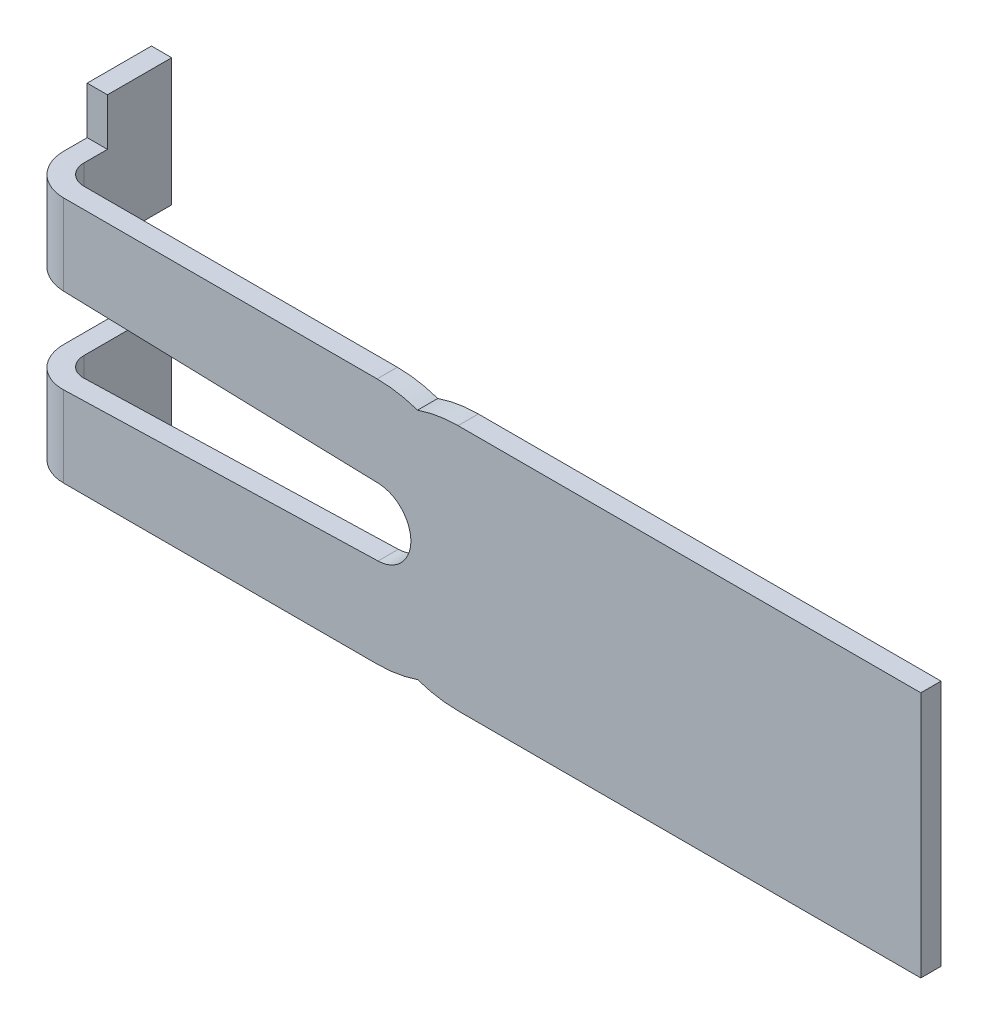
ISO-10303-21;
HEADER;
FILE_DESCRIPTION(('STEP AP214'),'2;1');
FILE_NAME('part.step','',(''),(''),'','','');
FILE_SCHEMA(('AUTOMOTIVE_DESIGN { 1 0 10303 214 1 1 1 1 }'));
ENDSEC;
DATA;
#1=APPLICATION_CONTEXT('core data for automotive mechanical design processes');
#2=APPLICATION_PROTOCOL_DEFINITION('international standard','automotive_design',2000,#1);
#3=PRODUCT_CONTEXT('',#1,'mechanical');
#4=PRODUCT('Part','Part','',(#3));
#5=PRODUCT_RELATED_PRODUCT_CATEGORY('part','',(#4));
#6=PRODUCT_DEFINITION_FORMATION('','',#4);
#7=PRODUCT_DEFINITION_CONTEXT('part definition',#1,'design');
#8=PRODUCT_DEFINITION('design','',#6,#7);
#9=PRODUCT_DEFINITION_SHAPE('','',#8);
#10=(LENGTH_UNIT() NAMED_UNIT(*) SI_UNIT(.MILLI.,.METRE.));
#11=(NAMED_UNIT(*) PLANE_ANGLE_UNIT() SI_UNIT($,.RADIAN.));
#12=(NAMED_UNIT(*) SI_UNIT($,.STERADIAN.) SOLID_ANGLE_UNIT());
#13=UNCERTAINTY_MEASURE_WITH_UNIT(LENGTH_MEASURE(1.E-05),#10,'distance_accuracy_value','');
#14=(GEOMETRIC_REPRESENTATION_CONTEXT(3) GLOBAL_UNCERTAINTY_ASSIGNED_CONTEXT((#13)) GLOBAL_UNIT_ASSIGNED_CONTEXT((#10,
#11,#12)) REPRESENTATION_CONTEXT('',''));
#15=CARTESIAN_POINT('',(0.,0.,0.));
#16=DIRECTION('',(0.,0.,1.));
#17=DIRECTION('',(1.,0.,0.));
#18=AXIS2_PLACEMENT_3D('',#15,#16,#17);
#19=CARTESIAN_POINT('',(0.300000000000002,1.83,1.9));
#20=DIRECTION('',(0.,0.,-1.));
#21=DIRECTION('',(-1.,0.,0.));
#22=AXIS2_PLACEMENT_3D('',#19,#20,#21);
#23=PLANE('',#22);
#24=CARTESIAN_POINT('',(6.14330650942758,0.,1.9));
#25=DIRECTION('',(0.,0.,-1.));
#26=DIRECTION('',(1.,0.,0.));
#27=AXIS2_PLACEMENT_3D('',#24,#25,#26);
#28=CIRCLE('',#27,1.83);
#29=CARTESIAN_POINT('',(6.14330650942758,-1.83,1.9));
#30=VERTEX_POINT('',#29);
#31=CARTESIAN_POINT('',(5.54330650942758,-1.72884354410687,1.9));
#32=VERTEX_POINT('',#31);
#33=EDGE_CURVE('E208',#30,#32,#28,.T.);
#34=ORIENTED_EDGE('',*,*,#33,.F.);
#35=DIRECTION('',(1.,0.,0.));
#36=VECTOR('',#35,1.);
#37=CARTESIAN_POINT('',(0.300000000000002,-1.83,1.9));
#38=LINE('',#37,#36);
#39=CARTESIAN_POINT('',(13.,-1.83,1.9));
#40=VERTEX_POINT('',#39);
#41=EDGE_CURVE('E441',#30,#40,#38,.T.);
#42=ORIENTED_EDGE('',*,*,#41,.T.);
#43=DIRECTION('',(0.,-1.,0.));
#44=VECTOR('',#43,1.);
#45=CARTESIAN_POINT('',(13.,1.83,1.9));
#46=LINE('',#45,#44);
#47=CARTESIAN_POINT('',(13.,1.83,1.9));
#48=VERTEX_POINT('',#47);
#49=EDGE_CURVE('E329',#48,#40,#46,.T.);
#50=ORIENTED_EDGE('',*,*,#49,.F.);
#51=DIRECTION('',(1.,0.,0.));
#52=VECTOR('',#51,1.);
#53=CARTESIAN_POINT('',(0.300000000000002,1.83,1.9));
#54=LINE('',#53,#52);
#55=CARTESIAN_POINT('',(6.14330650942758,1.83,1.9));
#56=VERTEX_POINT('',#55);
#57=EDGE_CURVE('E307',#56,#48,#54,.T.);
#58=ORIENTED_EDGE('',*,*,#57,.F.);
#59=CARTESIAN_POINT('',(6.14330650942758,0.,1.9));
#60=DIRECTION('',(0.,0.,-1.));
#61=DIRECTION('',(1.,0.,0.));
#62=AXIS2_PLACEMENT_3D('',#59,#60,#61);
#63=CIRCLE('',#62,1.83);
#64=CARTESIAN_POINT('',(5.54330650942758,1.72884354410687,1.9));
#65=VERTEX_POINT('',#64);
#66=EDGE_CURVE('E232',#65,#56,#63,.T.);
#67=ORIENTED_EDGE('',*,*,#66,.F.);
#68=CARTESIAN_POINT('',(4.94330650942758,0.,1.9));
#69=DIRECTION('',(0.,0.,-1.));
#70=DIRECTION('',(1.,0.,0.));
#71=AXIS2_PLACEMENT_3D('',#68,#69,#70);
#72=CIRCLE('',#71,1.83);
#73=CARTESIAN_POINT('',(4.94330650942758,1.83,1.9));
#74=VERTEX_POINT('',#73);
#75=EDGE_CURVE('E234',#74,#65,#72,.T.);
#76=ORIENTED_EDGE('',*,*,#75,.F.);
#77=CARTESIAN_POINT('',(0.300000000000002,1.83,1.9));
#78=VERTEX_POINT('',#77);
#79=EDGE_CURVE('E308',#78,#74,#54,.T.);
#80=ORIENTED_EDGE('',*,*,#79,.F.);
#81=DIRECTION('',(0.,-1.,0.));
#82=VECTOR('',#81,1.);
#83=CARTESIAN_POINT('',(0.300000000000002,1.83,1.9));
#84=LINE('',#83,#82);
#85=CARTESIAN_POINT('',(0.300000000000002,0.632858603308353,1.9));
#86=VERTEX_POINT('',#85);
#87=EDGE_CURVE('E355',#78,#86,#84,.T.);
#88=ORIENTED_EDGE('',*,*,#87,.T.);
#89=DIRECTION('',(-0.999592155917968,0.0285573427907472,0.));
#90=VECTOR('',#89,1.);
#91=CARTESIAN_POINT('',(-0.3,0.65,1.9));
#92=LINE('',#91,#90);
#93=CARTESIAN_POINT('',(4.95758518082296,0.499796077958984,1.9));
#94=VERTEX_POINT('',#93);
#95=EDGE_CURVE('E416',#94,#86,#92,.T.);
#96=ORIENTED_EDGE('',*,*,#95,.F.);
#97=CARTESIAN_POINT('',(4.94330650942758,0.,1.9));
#98=DIRECTION('',(0.,0.,1.));
#99=DIRECTION('',(1.,0.,0.));
#100=AXIS2_PLACEMENT_3D('',#97,#98,#99);
#101=CIRCLE('',#100,0.5);
#102=CARTESIAN_POINT('',(4.95758518082296,-0.499796077958984,1.9));
#103=VERTEX_POINT('',#102);
#104=EDGE_CURVE('E414',#103,#94,#101,.T.);
#105=ORIENTED_EDGE('',*,*,#104,.F.);
#106=DIRECTION('',(0.999592155917968,0.0285573427907472,0.));
#107=VECTOR('',#106,1.);
#108=CARTESIAN_POINT('',(-0.3,-0.65,1.9));
#109=LINE('',#108,#107);
#110=CARTESIAN_POINT('',(0.3,-0.632858603308353,1.9));
#111=VERTEX_POINT('',#110);
#112=EDGE_CURVE('E412',#111,#103,#109,.T.);
#113=ORIENTED_EDGE('',*,*,#112,.F.);
#114=CARTESIAN_POINT('',(0.300000000000002,-1.83,1.9));
#115=VERTEX_POINT('',#114);
#116=EDGE_CURVE('E357',#111,#115,#84,.T.);
#117=ORIENTED_EDGE('',*,*,#116,.T.);
#118=CARTESIAN_POINT('',(4.94330650942758,-1.83,1.9));
#119=VERTEX_POINT('',#118);
#120=EDGE_CURVE('E224',#115,#119,#38,.T.);
#121=ORIENTED_EDGE('',*,*,#120,.T.);
#122=CARTESIAN_POINT('',(4.94330650942758,0.,1.9));
#123=DIRECTION('',(0.,0.,-1.));
#124=DIRECTION('',(1.,0.,0.));
#125=AXIS2_PLACEMENT_3D('',#122,#123,#124);
#126=CIRCLE('',#125,1.83);
#127=EDGE_CURVE('E48',#32,#119,#126,.T.);
#128=ORIENTED_EDGE('',*,*,#127,.F.);
#129=EDGE_LOOP('',(#34,#42,#50,#58,#67,#76,#80,#88,#96,#105,#113,#117,#121,#128));
#130=FACE_BOUND('',#129,.T.);
#131=ADVANCED_FACE('F32',(#130),#23,.F.);
#132=CARTESIAN_POINT('',(0.300000000000002,1.83,1.6));
#133=DIRECTION('',(0.,0.,-1.));
#134=DIRECTION('',(-1.,0.,0.));
#135=AXIS2_PLACEMENT_3D('',#132,#133,#134);
#136=PLANE('',#135);
#137=DIRECTION('',(1.,0.,0.));
#138=VECTOR('',#137,1.);
#139=CARTESIAN_POINT('',(0.300000000000002,-1.83,1.6));
#140=LINE('',#139,#138);
#141=CARTESIAN_POINT('',(6.14330650942758,-1.83,1.6));
#142=VERTEX_POINT('',#141);
#143=CARTESIAN_POINT('',(13.,-1.83,1.6));
#144=VERTEX_POINT('',#143);
#145=EDGE_CURVE('E446',#142,#144,#140,.T.);
#146=ORIENTED_EDGE('',*,*,#145,.F.);
#147=CARTESIAN_POINT('',(6.14330650942758,0.,1.6));
#148=DIRECTION('',(0.,0.,-1.));
#149=DIRECTION('',(-1.,0.,0.));
#150=AXIS2_PLACEMENT_3D('',#147,#148,#149);
#151=CIRCLE('',#150,1.83);
#152=CARTESIAN_POINT('',(5.54330650942758,-1.72884354410687,1.6));
#153=VERTEX_POINT('',#152);
#154=EDGE_CURVE('E230',#142,#153,#151,.T.);
#155=ORIENTED_EDGE('',*,*,#154,.T.);
#156=CARTESIAN_POINT('',(4.94330650942758,0.,1.6));
#157=DIRECTION('',(0.,0.,-1.));
#158=DIRECTION('',(-1.,0.,0.));
#159=AXIS2_PLACEMENT_3D('',#156,#157,#158);
#160=CIRCLE('',#159,1.83);
#161=CARTESIAN_POINT('',(4.94330650942758,-1.83,1.6));
#162=VERTEX_POINT('',#161);
#163=EDGE_CURVE('E219',#153,#162,#160,.T.);
#164=ORIENTED_EDGE('',*,*,#163,.T.);
#165=CARTESIAN_POINT('',(0.300000000000002,-1.83,1.6));
#166=VERTEX_POINT('',#165);
#167=EDGE_CURVE('E447',#166,#162,#140,.T.);
#168=ORIENTED_EDGE('',*,*,#167,.F.);
#169=DIRECTION('',(0.,-1.,0.));
#170=VECTOR('',#169,1.);
#171=CARTESIAN_POINT('',(0.300000000000002,1.83,1.6));
#172=LINE('',#171,#170);
#173=CARTESIAN_POINT('',(0.300000000000002,-0.632858603308353,1.6));
#174=VERTEX_POINT('',#173);
#175=EDGE_CURVE('E338',#174,#166,#172,.T.);
#176=ORIENTED_EDGE('',*,*,#175,.F.);
#177=DIRECTION('',(0.999592155917968,0.0285573427907472,0.));
#178=VECTOR('',#177,1.);
#179=CARTESIAN_POINT('',(0.37030401260542,-0.63085008835988,1.6));
#180=LINE('',#179,#178);
#181=CARTESIAN_POINT('',(4.95758518082296,-0.499796077958984,1.6));
#182=VERTEX_POINT('',#181);
#183=EDGE_CURVE('E438',#174,#182,#180,.T.);
#184=ORIENTED_EDGE('',*,*,#183,.T.);
#185=CARTESIAN_POINT('',(4.94330650942758,0.,1.6));
#186=DIRECTION('',(0.,0.,-1.));
#187=DIRECTION('',(-1.,0.,0.));
#188=AXIS2_PLACEMENT_3D('',#185,#186,#187);
#189=CIRCLE('',#188,0.5);
#190=CARTESIAN_POINT('',(4.95758518082296,0.499796077958984,1.6));
#191=VERTEX_POINT('',#190);
#192=EDGE_CURVE('E11',#182,#191,#189,.F.);
#193=ORIENTED_EDGE('',*,*,#192,.T.);
#194=DIRECTION('',(-0.999592155917968,0.0285573427907472,0.));
#195=VECTOR('',#194,1.);
#196=CARTESIAN_POINT('',(0.265826765803601,0.633834898247682,1.6));
#197=LINE('',#196,#195);
#198=CARTESIAN_POINT('',(0.300000000000002,0.632858603308353,1.6));
#199=VERTEX_POINT('',#198);
#200=EDGE_CURVE('E383',#191,#199,#197,.T.);
#201=ORIENTED_EDGE('',*,*,#200,.T.);
#202=CARTESIAN_POINT('',(0.300000000000002,1.83,1.6));
#203=VERTEX_POINT('',#202);
#204=EDGE_CURVE('E335',#203,#199,#172,.T.);
#205=ORIENTED_EDGE('',*,*,#204,.F.);
#206=DIRECTION('',(1.,0.,0.));
#207=VECTOR('',#206,1.);
#208=CARTESIAN_POINT('',(0.300000000000002,1.83,1.6));
#209=LINE('',#208,#207);
#210=CARTESIAN_POINT('',(4.94330650942758,1.83,1.6));
#211=VERTEX_POINT('',#210);
#212=EDGE_CURVE('E315',#203,#211,#209,.T.);
#213=ORIENTED_EDGE('',*,*,#212,.T.);
#214=CARTESIAN_POINT('',(4.94330650942758,0.,1.6));
#215=DIRECTION('',(0.,0.,-1.));
#216=DIRECTION('',(-1.,0.,0.));
#217=AXIS2_PLACEMENT_3D('',#214,#215,#216);
#218=CIRCLE('',#217,1.83);
#219=CARTESIAN_POINT('',(5.54330650942758,1.72884354410687,1.6));
#220=VERTEX_POINT('',#219);
#221=EDGE_CURVE('E56',#211,#220,#218,.T.);
#222=ORIENTED_EDGE('',*,*,#221,.T.);
#223=CARTESIAN_POINT('',(6.14330650942758,0.,1.6));
#224=DIRECTION('',(0.,0.,-1.));
#225=DIRECTION('',(-1.,0.,0.));
#226=AXIS2_PLACEMENT_3D('',#223,#224,#225);
#227=CIRCLE('',#226,1.83);
#228=CARTESIAN_POINT('',(6.14330650942758,1.83,1.6));
#229=VERTEX_POINT('',#228);
#230=EDGE_CURVE('E243',#220,#229,#227,.T.);
#231=ORIENTED_EDGE('',*,*,#230,.T.);
#232=CARTESIAN_POINT('',(13.,1.83,1.6));
#233=VERTEX_POINT('',#232);
#234=EDGE_CURVE('E314',#229,#233,#209,.T.);
#235=ORIENTED_EDGE('',*,*,#234,.T.);
#236=DIRECTION('',(0.,-1.,0.));
#237=VECTOR('',#236,1.);
#238=CARTESIAN_POINT('',(13.,1.83,1.6));
#239=LINE('',#238,#237);
#240=EDGE_CURVE('E332',#233,#144,#239,.T.);
#241=ORIENTED_EDGE('',*,*,#240,.T.);
#242=EDGE_LOOP('',(#146,#155,#164,#168,#176,#184,#193,#201,#205,#213,#222,#231,#235,#241));
#243=FACE_BOUND('',#242,.T.);
#244=ADVANCED_FACE('F381',(#243),#136,.T.);
#245=CARTESIAN_POINT('',(0.3,-1.83,1.3));
#246=DIRECTION('',(0.,1.,0.));
#247=DIRECTION('',(0.,0.,1.));
#248=AXIS2_PLACEMENT_3D('',#245,#246,#247);
#249=PLANE('',#248);
#250=DIRECTION('',(0.,0.,-1.));
#251=VECTOR('',#250,1.);
#252=CARTESIAN_POINT('',(4.94330650942758,-1.83,1.9));
#253=LINE('',#252,#251);
#254=EDGE_CURVE('E220',#119,#162,#253,.T.);
#255=ORIENTED_EDGE('',*,*,#254,.F.);
#256=ORIENTED_EDGE('',*,*,#120,.F.);
#257=CARTESIAN_POINT('',(0.3,-1.83,1.3));
#258=DIRECTION('',(0.,1.,0.));
#259=DIRECTION('',(1.,0.,0.));
#260=AXIS2_PLACEMENT_3D('',#257,#258,#259);
#261=CIRCLE('',#260,0.6);
#262=CARTESIAN_POINT('',(-0.3,-1.83,1.3));
#263=VERTEX_POINT('',#262);
#264=EDGE_CURVE('E300',#263,#115,#261,.T.);
#265=ORIENTED_EDGE('',*,*,#264,.F.);
#266=DIRECTION('',(0.,0.,1.));
#267=VECTOR('',#266,1.);
#268=CARTESIAN_POINT('',(-0.3,-1.83,0.));
#269=LINE('',#268,#267);
#270=CARTESIAN_POINT('',(-0.3,-1.83,0.952232616032771));
#271=VERTEX_POINT('',#270);
#272=EDGE_CURVE('E298',#271,#263,#269,.T.);
#273=ORIENTED_EDGE('',*,*,#272,.F.);
#274=DIRECTION('',(1.,0.,0.));
#275=VECTOR('',#274,1.);
#276=CARTESIAN_POINT('',(0.,-1.83,0.952232616032771));
#277=LINE('',#276,#275);
#278=CARTESIAN_POINT('',(0.,-1.83,0.952232616032771));
#279=VERTEX_POINT('',#278);
#280=EDGE_CURVE('E246',#271,#279,#277,.T.);
#281=ORIENTED_EDGE('',*,*,#280,.T.);
#282=DIRECTION('',(0.,0.,1.));
#283=VECTOR('',#282,1.);
#284=CARTESIAN_POINT('',(0.,-1.83,0.));
#285=LINE('',#284,#283);
#286=CARTESIAN_POINT('',(0.,-1.83,1.3));
#287=VERTEX_POINT('',#286);
#288=EDGE_CURVE('E255',#279,#287,#285,.T.);
#289=ORIENTED_EDGE('',*,*,#288,.T.);
#290=CARTESIAN_POINT('',(0.3,-1.83,1.3));
#291=DIRECTION('',(0.,1.,0.));
#292=DIRECTION('',(0.,0.,-1.));
#293=AXIS2_PLACEMENT_3D('',#290,#291,#292);
#294=CIRCLE('',#293,0.3);
#295=EDGE_CURVE('E449',#287,#166,#294,.T.);
#296=ORIENTED_EDGE('',*,*,#295,.T.);
#297=ORIENTED_EDGE('',*,*,#167,.T.);
#298=EDGE_LOOP('',(#255,#256,#265,#273,#281,#289,#296,#297));
#299=FACE_BOUND('',#298,.T.);
#300=ADVANCED_FACE('F455',(#299),#249,.F.);
#301=CARTESIAN_POINT('',(0.3,1.83,1.3));
#302=DIRECTION('',(0.,1.,0.));
#303=DIRECTION('',(0.,0.,1.));
#304=AXIS2_PLACEMENT_3D('',#301,#302,#303);
#305=PLANE('',#304);
#306=ORIENTED_EDGE('',*,*,#79,.T.);
#307=DIRECTION('',(0.,0.,-1.));
#308=VECTOR('',#307,1.);
#309=CARTESIAN_POINT('',(4.94330650942758,1.83,1.9));
#310=LINE('',#309,#308);
#311=EDGE_CURVE('E238',#74,#211,#310,.T.);
#312=ORIENTED_EDGE('',*,*,#311,.T.);
#313=ORIENTED_EDGE('',*,*,#212,.F.);
#314=CARTESIAN_POINT('',(0.3,1.83,1.3));
#315=DIRECTION('',(0.,1.,0.));
#316=DIRECTION('',(0.,0.,-1.));
#317=AXIS2_PLACEMENT_3D('',#314,#315,#316);
#318=CIRCLE('',#317,0.3);
#319=CARTESIAN_POINT('',(0.,1.83,1.3));
#320=VERTEX_POINT('',#319);
#321=EDGE_CURVE('E318',#320,#203,#318,.T.);
#322=ORIENTED_EDGE('',*,*,#321,.F.);
#323=DIRECTION('',(0.,0.,1.));
#324=VECTOR('',#323,1.);
#325=CARTESIAN_POINT('',(0.,1.83,0.));
#326=LINE('',#325,#324);
#327=CARTESIAN_POINT('',(0.,1.83,0.952232616032771));
#328=VERTEX_POINT('',#327);
#329=EDGE_CURVE('E321',#328,#320,#326,.T.);
#330=ORIENTED_EDGE('',*,*,#329,.F.);
#331=DIRECTION('',(1.,0.,0.));
#332=VECTOR('',#331,1.);
#333=CARTESIAN_POINT('',(0.,1.83,0.952232616032771));
#334=LINE('',#333,#332);
#335=CARTESIAN_POINT('',(-0.3,1.83,0.952232616032771));
#336=VERTEX_POINT('',#335);
#337=EDGE_CURVE('E260',#336,#328,#334,.T.);
#338=ORIENTED_EDGE('',*,*,#337,.F.);
#339=DIRECTION('',(0.,0.,1.));
#340=VECTOR('',#339,1.);
#341=CARTESIAN_POINT('',(-0.3,1.83,0.));
#342=LINE('',#341,#340);
#343=CARTESIAN_POINT('',(-0.3,1.83,1.3));
#344=VERTEX_POINT('',#343);
#345=EDGE_CURVE('E284',#336,#344,#342,.T.);
#346=ORIENTED_EDGE('',*,*,#345,.T.);
#347=CARTESIAN_POINT('',(0.3,1.83,1.3));
#348=DIRECTION('',(0.,1.,0.));
#349=DIRECTION('',(1.,0.,0.));
#350=AXIS2_PLACEMENT_3D('',#347,#348,#349);
#351=CIRCLE('',#350,0.6);
#352=EDGE_CURVE('E358',#344,#78,#351,.T.);
#353=ORIENTED_EDGE('',*,*,#352,.T.);
#354=EDGE_LOOP('',(#306,#312,#313,#322,#330,#338,#346,#353));
#355=FACE_BOUND('',#354,.T.);
#356=ADVANCED_FACE('F364',(#355),#305,.T.);
#357=CARTESIAN_POINT('',(0.3,1.83,1.3));
#358=DIRECTION('',(0.,-1.,0.));
#359=DIRECTION('',(0.,0.,-1.));
#360=AXIS2_PLACEMENT_3D('',#357,#358,#359);
#361=CYLINDRICAL_SURFACE('',#360,0.3);
#362=DIRECTION('',(0.,-1.,0.));
#363=VECTOR('',#362,1.);
#364=CARTESIAN_POINT('',(0.,1.83,1.3));
#365=LINE('',#364,#363);
#366=CARTESIAN_POINT('',(0.,-0.641429301654177,1.3));
#367=VERTEX_POINT('',#366);
#368=EDGE_CURVE('E342',#367,#287,#365,.T.);
#369=ORIENTED_EDGE('',*,*,#368,.F.);
#370=CARTESIAN_POINT('',(0.3,-0.632858603308353,1.3));
#371=DIRECTION('',(-0.0285573427907472,0.999592155917968,0.));
#372=DIRECTION('',(-0.999592155917968,-0.0285573427907472,0.));
#373=AXIS2_PLACEMENT_3D('',#370,#371,#372);
#374=ELLIPSE('',#373,0.300122403146008,0.3);
#375=EDGE_CURVE('E435',#367,#174,#374,.T.);
#376=ORIENTED_EDGE('',*,*,#375,.T.);
#377=ORIENTED_EDGE('',*,*,#175,.T.);
#378=ORIENTED_EDGE('',*,*,#295,.F.);
#379=EDGE_LOOP('',(#369,#376,#377,#378));
#380=FACE_BOUND('',#379,.T.);
#381=ADVANCED_FACE('F462',(#380),#361,.F.);
#382=ORIENTED_EDGE('',*,*,#204,.T.);
#383=CARTESIAN_POINT('',(0.3,0.632858603308353,1.3));
#384=DIRECTION('',(-0.0285573427907472,-0.999592155917968,0.));
#385=DIRECTION('',(0.999592155917968,-0.0285573427907472,0.));
#386=AXIS2_PLACEMENT_3D('',#383,#384,#385);
#387=ELLIPSE('',#386,0.300122403146008,0.3);
#388=CARTESIAN_POINT('',(0.,0.641429301654177,1.3));
#389=VERTEX_POINT('',#388);
#390=EDGE_CURVE('E388',#199,#389,#387,.T.);
#391=ORIENTED_EDGE('',*,*,#390,.T.);
#392=EDGE_CURVE('E339',#320,#389,#365,.T.);
#393=ORIENTED_EDGE('',*,*,#392,.F.);
#394=ORIENTED_EDGE('',*,*,#321,.T.);
#395=EDGE_LOOP('',(#382,#391,#393,#394));
#396=FACE_BOUND('',#395,.T.);
#397=ADVANCED_FACE('F386',(#396),#361,.F.);
#398=CARTESIAN_POINT('',(0.,1.83,0.));
#399=DIRECTION('',(1.,0.,0.));
#400=DIRECTION('',(0.,0.,-1.));
#401=AXIS2_PLACEMENT_3D('',#398,#399,#400);
#402=PLANE('',#401);
#403=DIRECTION('',(0.,-1.,0.));
#404=VECTOR('',#403,1.);
#405=CARTESIAN_POINT('',(0.,1.83,0.));
#406=LINE('',#405,#404);
#407=CARTESIAN_POINT('',(0.,-0.641429301654177,0.));
#408=VERTEX_POINT('',#407);
#409=CARTESIAN_POINT('',(0.,-2.53,0.));
#410=VERTEX_POINT('',#409);
#411=EDGE_CURVE('E346',#408,#410,#406,.T.);
#412=ORIENTED_EDGE('',*,*,#411,.F.);
#413=DIRECTION('',(0.,0.,1.));
#414=VECTOR('',#413,1.);
#415=CARTESIAN_POINT('',(0.,-0.641429301654177,0.));
#416=LINE('',#415,#414);
#417=EDGE_CURVE('E432',#408,#367,#416,.T.);
#418=ORIENTED_EDGE('',*,*,#417,.T.);
#419=ORIENTED_EDGE('',*,*,#368,.T.);
#420=ORIENTED_EDGE('',*,*,#288,.F.);
#421=DIRECTION('',(0.,1.,0.));
#422=VECTOR('',#421,1.);
#423=CARTESIAN_POINT('',(0.,-2.53,0.952232616032771));
#424=LINE('',#423,#422);
#425=CARTESIAN_POINT('',(0.,-2.53,0.952232616032771));
#426=VERTEX_POINT('',#425);
#427=EDGE_CURVE('E258',#426,#279,#424,.T.);
#428=ORIENTED_EDGE('',*,*,#427,.F.);
#429=DIRECTION('',(0.,0.,-1.));
#430=VECTOR('',#429,1.);
#431=CARTESIAN_POINT('',(0.,-2.53,0.));
#432=LINE('',#431,#430);
#433=EDGE_CURVE('E249',#426,#410,#432,.T.);
#434=ORIENTED_EDGE('',*,*,#433,.T.);
#435=EDGE_LOOP('',(#412,#418,#419,#420,#428,#434));
#436=FACE_BOUND('',#435,.T.);
#437=ADVANCED_FACE('F460',(#436),#402,.T.);
#438=ORIENTED_EDGE('',*,*,#392,.T.);
#439=DIRECTION('',(0.,0.,-1.));
#440=VECTOR('',#439,1.);
#441=CARTESIAN_POINT('',(0.,0.641429301654177,0.));
#442=LINE('',#441,#440);
#443=CARTESIAN_POINT('',(0.,0.641429301654177,0.));
#444=VERTEX_POINT('',#443);
#445=EDGE_CURVE('E428',#389,#444,#442,.T.);
#446=ORIENTED_EDGE('',*,*,#445,.T.);
#447=CARTESIAN_POINT('',(0.,2.53,0.));
#448=VERTEX_POINT('',#447);
#449=EDGE_CURVE('E343',#448,#444,#406,.T.);
#450=ORIENTED_EDGE('',*,*,#449,.F.);
#451=DIRECTION('',(0.,0.,-1.));
#452=VECTOR('',#451,1.);
#453=CARTESIAN_POINT('',(0.,2.53,0.));
#454=LINE('',#453,#452);
#455=CARTESIAN_POINT('',(0.,2.53,0.952232616032771));
#456=VERTEX_POINT('',#455);
#457=EDGE_CURVE('E278',#456,#448,#454,.T.);
#458=ORIENTED_EDGE('',*,*,#457,.F.);
#459=DIRECTION('',(0.,-1.,0.));
#460=VECTOR('',#459,1.);
#461=CARTESIAN_POINT('',(0.,2.53,0.952232616032771));
#462=LINE('',#461,#460);
#463=EDGE_CURVE('E287',#456,#328,#462,.T.);
#464=ORIENTED_EDGE('',*,*,#463,.T.);
#465=ORIENTED_EDGE('',*,*,#329,.T.);
#466=EDGE_LOOP('',(#438,#446,#450,#458,#464,#465));
#467=FACE_BOUND('',#466,.T.);
#468=ADVANCED_FACE('F395',(#467),#402,.T.);
#469=CARTESIAN_POINT('',(-0.3,1.83,0.));
#470=DIRECTION('',(0.,0.,-1.));
#471=DIRECTION('',(-1.,0.,0.));
#472=AXIS2_PLACEMENT_3D('',#469,#470,#471);
#473=PLANE('',#472);
#474=DIRECTION('',(0.,-1.,0.));
#475=VECTOR('',#474,1.);
#476=CARTESIAN_POINT('',(-0.3,1.83,0.));
#477=LINE('',#476,#475);
#478=CARTESIAN_POINT('',(-0.3,-0.65,0.));
#479=VERTEX_POINT('',#478);
#480=CARTESIAN_POINT('',(-0.3,-2.53,0.));
#481=VERTEX_POINT('',#480);
#482=EDGE_CURVE('E350',#479,#481,#477,.T.);
#483=ORIENTED_EDGE('',*,*,#482,.F.);
#484=DIRECTION('',(0.999592155917968,0.0285573427907472,0.));
#485=VECTOR('',#484,1.);
#486=CARTESIAN_POINT('',(-0.3,-0.65,0.));
#487=LINE('',#486,#485);
#488=EDGE_CURVE('E296',#479,#408,#487,.T.);
#489=ORIENTED_EDGE('',*,*,#488,.T.);
#490=ORIENTED_EDGE('',*,*,#411,.T.);
#491=DIRECTION('',(-1.,0.,0.));
#492=VECTOR('',#491,1.);
#493=CARTESIAN_POINT('',(0.,-2.53,0.));
#494=LINE('',#493,#492);
#495=EDGE_CURVE('E263',#410,#481,#494,.T.);
#496=ORIENTED_EDGE('',*,*,#495,.T.);
#497=EDGE_LOOP('',(#483,#489,#490,#496));
#498=FACE_BOUND('',#497,.T.);
#499=ADVANCED_FACE('F475',(#498),#473,.T.);
#500=ORIENTED_EDGE('',*,*,#449,.T.);
#501=DIRECTION('',(-0.999592155917968,0.0285573427907472,0.));
#502=VECTOR('',#501,1.);
#503=CARTESIAN_POINT('',(-0.3,0.65,0.));
#504=LINE('',#503,#502);
#505=CARTESIAN_POINT('',(-0.3,0.65,0.));
#506=VERTEX_POINT('',#505);
#507=EDGE_CURVE('E409',#444,#506,#504,.T.);
#508=ORIENTED_EDGE('',*,*,#507,.T.);
#509=CARTESIAN_POINT('',(-0.3,2.53,0.));
#510=VERTEX_POINT('',#509);
#511=EDGE_CURVE('E347',#510,#506,#477,.T.);
#512=ORIENTED_EDGE('',*,*,#511,.F.);
#513=DIRECTION('',(-1.,0.,0.));
#514=VECTOR('',#513,1.);
#515=CARTESIAN_POINT('',(0.,2.53,0.));
#516=LINE('',#515,#514);
#517=EDGE_CURVE('E401',#448,#510,#516,.T.);
#518=ORIENTED_EDGE('',*,*,#517,.F.);
#519=EDGE_LOOP('',(#500,#508,#512,#518));
#520=FACE_BOUND('',#519,.T.);
#521=ADVANCED_FACE('F662',(#520),#473,.T.);
#522=CARTESIAN_POINT('',(-0.3,1.83,0.));
#523=DIRECTION('',(1.,0.,0.));
#524=DIRECTION('',(0.,0.,-1.));
#525=AXIS2_PLACEMENT_3D('',#522,#523,#524);
#526=PLANE('',#525);
#527=DIRECTION('',(0.,0.,-1.));
#528=VECTOR('',#527,1.);
#529=CARTESIAN_POINT('',(-0.3,-0.65,1.9));
#530=LINE('',#529,#528);
#531=CARTESIAN_POINT('',(-0.3,-0.65,1.3));
#532=VERTEX_POINT('',#531);
#533=EDGE_CURVE('E425',#532,#479,#530,.T.);
#534=ORIENTED_EDGE('',*,*,#533,.T.);
#535=ORIENTED_EDGE('',*,*,#482,.T.);
#536=DIRECTION('',(0.,0.,1.));
#537=VECTOR('',#536,1.);
#538=CARTESIAN_POINT('',(-0.3,-2.53,0.));
#539=LINE('',#538,#537);
#540=CARTESIAN_POINT('',(-0.3,-2.53,0.952232616032771));
#541=VERTEX_POINT('',#540);
#542=EDGE_CURVE('E268',#481,#541,#539,.T.);
#543=ORIENTED_EDGE('',*,*,#542,.T.);
#544=DIRECTION('',(0.,1.,0.));
#545=VECTOR('',#544,1.);
#546=CARTESIAN_POINT('',(-0.3,-2.53,0.952232616032771));
#547=LINE('',#546,#545);
#548=EDGE_CURVE('E261',#541,#271,#547,.T.);
#549=ORIENTED_EDGE('',*,*,#548,.T.);
#550=ORIENTED_EDGE('',*,*,#272,.T.);
#551=DIRECTION('',(0.,-1.,0.));
#552=VECTOR('',#551,1.);
#553=CARTESIAN_POINT('',(-0.3,1.83,1.3));
#554=LINE('',#553,#552);
#555=EDGE_CURVE('E354',#532,#263,#554,.T.);
#556=ORIENTED_EDGE('',*,*,#555,.F.);
#557=EDGE_LOOP('',(#534,#535,#543,#549,#550,#556));
#558=FACE_BOUND('',#557,.T.);
#559=ADVANCED_FACE('F472',(#558),#526,.F.);
#560=DIRECTION('',(0.,0.,-1.));
#561=VECTOR('',#560,1.);
#562=CARTESIAN_POINT('',(-0.3,0.65,1.9));
#563=LINE('',#562,#561);
#564=CARTESIAN_POINT('',(-0.3,0.65,1.3));
#565=VERTEX_POINT('',#564);
#566=EDGE_CURVE('E369',#565,#506,#563,.T.);
#567=ORIENTED_EDGE('',*,*,#566,.F.);
#568=EDGE_CURVE('E351',#344,#565,#554,.T.);
#569=ORIENTED_EDGE('',*,*,#568,.F.);
#570=ORIENTED_EDGE('',*,*,#345,.F.);
#571=DIRECTION('',(0.,-1.,0.));
#572=VECTOR('',#571,1.);
#573=CARTESIAN_POINT('',(-0.3,2.53,0.952232616032771));
#574=LINE('',#573,#572);
#575=CARTESIAN_POINT('',(-0.3,2.53,0.952232616032771));
#576=VERTEX_POINT('',#575);
#577=EDGE_CURVE('E290',#576,#336,#574,.T.);
#578=ORIENTED_EDGE('',*,*,#577,.F.);
#579=DIRECTION('',(0.,0.,1.));
#580=VECTOR('',#579,1.);
#581=CARTESIAN_POINT('',(-0.3,2.53,0.));
#582=LINE('',#581,#580);
#583=EDGE_CURVE('E402',#510,#576,#582,.T.);
#584=ORIENTED_EDGE('',*,*,#583,.F.);
#585=ORIENTED_EDGE('',*,*,#511,.T.);
#586=EDGE_LOOP('',(#567,#569,#570,#578,#584,#585));
#587=FACE_BOUND('',#586,.T.);
#588=ADVANCED_FACE('F368',(#587),#526,.F.);
#589=CARTESIAN_POINT('',(0.3,1.83,1.3));
#590=DIRECTION('',(0.,-1.,0.));
#591=DIRECTION('',(0.,0.,-1.));
#592=AXIS2_PLACEMENT_3D('',#589,#590,#591);
#593=CYLINDRICAL_SURFACE('',#592,0.6);
#594=CARTESIAN_POINT('',(0.3,-0.632858603308353,1.3));
#595=DIRECTION('',(-0.0285573427907472,0.999592155917968,0.));
#596=DIRECTION('',(-0.999592155917968,-0.0285573427907472,0.));
#597=AXIS2_PLACEMENT_3D('',#594,#595,#596);
#598=ELLIPSE('',#597,0.600244806292016,0.6);
#599=EDGE_CURVE('E40',#532,#111,#598,.T.);
#600=ORIENTED_EDGE('',*,*,#599,.F.);
#601=ORIENTED_EDGE('',*,*,#555,.T.);
#602=ORIENTED_EDGE('',*,*,#264,.T.);
#603=ORIENTED_EDGE('',*,*,#116,.F.);
#604=EDGE_LOOP('',(#600,#601,#602,#603));
#605=FACE_BOUND('',#604,.T.);
#606=ADVANCED_FACE('F470',(#605),#593,.T.);
#607=CARTESIAN_POINT('',(0.3,0.632858603308353,1.3));
#608=DIRECTION('',(-0.0285573427907472,-0.999592155917968,0.));
#609=DIRECTION('',(0.999592155917968,-0.0285573427907472,0.));
#610=AXIS2_PLACEMENT_3D('',#607,#608,#609);
#611=ELLIPSE('',#610,0.600244806292016,0.6);
#612=EDGE_CURVE('E327',#86,#565,#611,.T.);
#613=ORIENTED_EDGE('',*,*,#612,.F.);
#614=ORIENTED_EDGE('',*,*,#87,.F.);
#615=ORIENTED_EDGE('',*,*,#352,.F.);
#616=ORIENTED_EDGE('',*,*,#568,.T.);
#617=EDGE_LOOP('',(#613,#614,#615,#616));
#618=FACE_BOUND('',#617,.T.);
#619=ADVANCED_FACE('F372',(#618),#593,.T.);
#620=CARTESIAN_POINT('',(13.,1.83,1.6));
#621=DIRECTION('',(1.,0.,0.));
#622=DIRECTION('',(0.,0.,-1.));
#623=AXIS2_PLACEMENT_3D('',#620,#621,#622);
#624=PLANE('',#623);
#625=DIRECTION('',(0.,0.,1.));
#626=VECTOR('',#625,1.);
#627=CARTESIAN_POINT('',(13.,-1.83,1.6));
#628=LINE('',#627,#626);
#629=EDGE_CURVE('E443',#144,#40,#628,.T.);
#630=ORIENTED_EDGE('',*,*,#629,.F.);
#631=ORIENTED_EDGE('',*,*,#240,.F.);
#632=DIRECTION('',(0.,0.,1.));
#633=VECTOR('',#632,1.);
#634=CARTESIAN_POINT('',(13.,1.83,1.6));
#635=LINE('',#634,#633);
#636=EDGE_CURVE('E311',#233,#48,#635,.T.);
#637=ORIENTED_EDGE('',*,*,#636,.T.);
#638=ORIENTED_EDGE('',*,*,#49,.T.);
#639=EDGE_LOOP('',(#630,#631,#637,#638));
#640=FACE_BOUND('',#639,.T.);
#641=ADVANCED_FACE('F506',(#640),#624,.T.);
#642=DIRECTION('',(0.,0.,-1.));
#643=VECTOR('',#642,1.);
#644=CARTESIAN_POINT('',(6.14330650942758,1.83,1.9));
#645=LINE('',#644,#643);
#646=EDGE_CURVE('E240',#56,#229,#645,.T.);
#647=ORIENTED_EDGE('',*,*,#646,.F.);
#648=ORIENTED_EDGE('',*,*,#57,.T.);
#649=ORIENTED_EDGE('',*,*,#636,.F.);
#650=ORIENTED_EDGE('',*,*,#234,.F.);
#651=EDGE_LOOP('',(#647,#648,#649,#650));
#652=FACE_BOUND('',#651,.T.);
#653=ADVANCED_FACE('F508',(#652),#305,.T.);
#654=ORIENTED_EDGE('',*,*,#41,.F.);
#655=DIRECTION('',(0.,0.,-1.));
#656=VECTOR('',#655,1.);
#657=CARTESIAN_POINT('',(6.14330650942758,-1.83,1.9));
#658=LINE('',#657,#656);
#659=EDGE_CURVE('E213',#30,#142,#658,.T.);
#660=ORIENTED_EDGE('',*,*,#659,.T.);
#661=ORIENTED_EDGE('',*,*,#145,.T.);
#662=ORIENTED_EDGE('',*,*,#629,.T.);
#663=EDGE_LOOP('',(#654,#660,#661,#662));
#664=FACE_BOUND('',#663,.T.);
#665=ADVANCED_FACE('F503',(#664),#249,.F.);
#666=CARTESIAN_POINT('',(-0.3,-0.65,1.9));
#667=DIRECTION('',(-0.0285573427907472,0.999592155917968,0.));
#668=DIRECTION('',(-0.999592155917968,-0.0285573427907472,0.));
#669=AXIS2_PLACEMENT_3D('',#666,#667,#668);
#670=PLANE('',#669);
#671=ORIENTED_EDGE('',*,*,#375,.F.);
#672=ORIENTED_EDGE('',*,*,#417,.F.);
#673=ORIENTED_EDGE('',*,*,#488,.F.);
#674=ORIENTED_EDGE('',*,*,#533,.F.);
#675=ORIENTED_EDGE('',*,*,#599,.T.);
#676=ORIENTED_EDGE('',*,*,#112,.T.);
#677=DIRECTION('',(0.,0.,-1.));
#678=VECTOR('',#677,1.);
#679=CARTESIAN_POINT('',(4.95758518082296,-0.499796077958984,1.9));
#680=LINE('',#679,#678);
#681=EDGE_CURVE('E422',#103,#182,#680,.T.);
#682=ORIENTED_EDGE('',*,*,#681,.T.);
#683=ORIENTED_EDGE('',*,*,#183,.F.);
#684=EDGE_LOOP('',(#671,#672,#673,#674,#675,#676,#682,#683));
#685=FACE_BOUND('',#684,.T.);
#686=ADVANCED_FACE('F604',(#685),#670,.T.);
#687=CARTESIAN_POINT('',(-0.3,0.65,1.9));
#688=DIRECTION('',(-0.0285573427907472,-0.999592155917968,0.));
#689=DIRECTION('',(0.999592155917968,-0.0285573427907472,0.));
#690=AXIS2_PLACEMENT_3D('',#687,#688,#689);
#691=PLANE('',#690);
#692=DIRECTION('',(0.,0.,-1.));
#693=VECTOR('',#692,1.);
#694=CARTESIAN_POINT('',(4.95758518082296,0.499796077958984,1.9));
#695=LINE('',#694,#693);
#696=EDGE_CURVE('E419',#94,#191,#695,.T.);
#697=ORIENTED_EDGE('',*,*,#696,.F.);
#698=ORIENTED_EDGE('',*,*,#95,.T.);
#699=ORIENTED_EDGE('',*,*,#612,.T.);
#700=ORIENTED_EDGE('',*,*,#566,.T.);
#701=ORIENTED_EDGE('',*,*,#507,.F.);
#702=ORIENTED_EDGE('',*,*,#445,.F.);
#703=ORIENTED_EDGE('',*,*,#390,.F.);
#704=ORIENTED_EDGE('',*,*,#200,.F.);
#705=EDGE_LOOP('',(#697,#698,#699,#700,#701,#702,#703,#704));
#706=FACE_BOUND('',#705,.T.);
#707=ADVANCED_FACE('F593',(#706),#691,.T.);
#708=CARTESIAN_POINT('',(4.94330650942758,0.,1.9));
#709=DIRECTION('',(0.,0.,-1.));
#710=DIRECTION('',(-1.,0.,0.));
#711=AXIS2_PLACEMENT_3D('',#708,#709,#710);
#712=CYLINDRICAL_SURFACE('',#711,0.5);
#713=ORIENTED_EDGE('',*,*,#681,.F.);
#714=ORIENTED_EDGE('',*,*,#104,.T.);
#715=ORIENTED_EDGE('',*,*,#696,.T.);
#716=ORIENTED_EDGE('',*,*,#192,.F.);
#717=EDGE_LOOP('',(#713,#714,#715,#716));
#718=FACE_BOUND('',#717,.T.);
#719=ADVANCED_FACE('F583',(#718),#712,.F.);
#720=CARTESIAN_POINT('',(0.,2.53,0.952232616032771));
#721=DIRECTION('',(0.,0.,-1.));
#722=DIRECTION('',(-1.,0.,0.));
#723=AXIS2_PLACEMENT_3D('',#720,#721,#722);
#724=PLANE('',#723);
#725=ORIENTED_EDGE('',*,*,#337,.T.);
#726=ORIENTED_EDGE('',*,*,#463,.F.);
#727=DIRECTION('',(1.,0.,0.));
#728=VECTOR('',#727,1.);
#729=CARTESIAN_POINT('',(0.,2.53,0.952232616032771));
#730=LINE('',#729,#728);
#731=EDGE_CURVE('E291',#576,#456,#730,.T.);
#732=ORIENTED_EDGE('',*,*,#731,.F.);
#733=ORIENTED_EDGE('',*,*,#577,.T.);
#734=EDGE_LOOP('',(#725,#726,#732,#733));
#735=FACE_BOUND('',#734,.T.);
#736=ADVANCED_FACE('F392',(#735),#724,.F.);
#737=CARTESIAN_POINT('',(0.,2.53,0.));
#738=DIRECTION('',(0.,-1.,0.));
#739=DIRECTION('',(0.,0.,-1.));
#740=AXIS2_PLACEMENT_3D('',#737,#738,#739);
#741=PLANE('',#740);
#742=ORIENTED_EDGE('',*,*,#457,.T.);
#743=ORIENTED_EDGE('',*,*,#517,.T.);
#744=ORIENTED_EDGE('',*,*,#583,.T.);
#745=ORIENTED_EDGE('',*,*,#731,.T.);
#746=EDGE_LOOP('',(#742,#743,#744,#745));
#747=FACE_BOUND('',#746,.T.);
#748=ADVANCED_FACE('F485',(#747),#741,.F.);
#749=CARTESIAN_POINT('',(0.,-2.53,0.952232616032771));
#750=DIRECTION('',(0.,0.,1.));
#751=DIRECTION('',(1.,0.,0.));
#752=AXIS2_PLACEMENT_3D('',#749,#750,#751);
#753=PLANE('',#752);
#754=ORIENTED_EDGE('',*,*,#280,.F.);
#755=ORIENTED_EDGE('',*,*,#548,.F.);
#756=DIRECTION('',(1.,0.,0.));
#757=VECTOR('',#756,1.);
#758=CARTESIAN_POINT('',(0.,-2.53,0.952232616032771));
#759=LINE('',#758,#757);
#760=EDGE_CURVE('E273',#541,#426,#759,.T.);
#761=ORIENTED_EDGE('',*,*,#760,.T.);
#762=ORIENTED_EDGE('',*,*,#427,.T.);
#763=EDGE_LOOP('',(#754,#755,#761,#762));
#764=FACE_BOUND('',#763,.T.);
#765=ADVANCED_FACE('F483',(#764),#753,.T.);
#766=CARTESIAN_POINT('',(0.,-2.53,0.));
#767=DIRECTION('',(0.,1.,0.));
#768=DIRECTION('',(0.,0.,-1.));
#769=AXIS2_PLACEMENT_3D('',#766,#767,#768);
#770=PLANE('',#769);
#771=ORIENTED_EDGE('',*,*,#433,.F.);
#772=ORIENTED_EDGE('',*,*,#760,.F.);
#773=ORIENTED_EDGE('',*,*,#542,.F.);
#774=ORIENTED_EDGE('',*,*,#495,.F.);
#775=EDGE_LOOP('',(#771,#772,#773,#774));
#776=FACE_BOUND('',#775,.T.);
#777=ADVANCED_FACE('F481',(#776),#770,.F.);
#778=CARTESIAN_POINT('',(6.14330650942758,0.,1.9));
#779=DIRECTION('',(0.,0.,-1.));
#780=DIRECTION('',(-1.,0.,0.));
#781=AXIS2_PLACEMENT_3D('',#778,#779,#780);
#782=CYLINDRICAL_SURFACE('',#781,1.83);
#783=DIRECTION('',(0.,0.,-1.));
#784=VECTOR('',#783,1.);
#785=CARTESIAN_POINT('',(5.54330650942758,1.72884354410687,1.9));
#786=LINE('',#785,#784);
#787=EDGE_CURVE('E236',#65,#220,#786,.T.);
#788=ORIENTED_EDGE('',*,*,#787,.F.);
#789=ORIENTED_EDGE('',*,*,#66,.T.);
#790=ORIENTED_EDGE('',*,*,#646,.T.);
#791=ORIENTED_EDGE('',*,*,#230,.F.);
#792=EDGE_LOOP('',(#788,#789,#790,#791));
#793=FACE_BOUND('',#792,.T.);
#794=ADVANCED_FACE('F491',(#793),#782,.T.);
#795=CARTESIAN_POINT('',(4.94330650942758,0.,1.9));
#796=DIRECTION('',(0.,0.,-1.));
#797=DIRECTION('',(-1.,0.,0.));
#798=AXIS2_PLACEMENT_3D('',#795,#796,#797);
#799=CYLINDRICAL_SURFACE('',#798,1.83);
#800=ORIENTED_EDGE('',*,*,#311,.F.);
#801=ORIENTED_EDGE('',*,*,#75,.T.);
#802=ORIENTED_EDGE('',*,*,#787,.T.);
#803=ORIENTED_EDGE('',*,*,#221,.F.);
#804=EDGE_LOOP('',(#800,#801,#802,#803));
#805=FACE_BOUND('',#804,.T.);
#806=ADVANCED_FACE('F527',(#805),#799,.T.);
#807=CARTESIAN_POINT('',(6.14330650942758,0.,1.9));
#808=DIRECTION('',(0.,0.,-1.));
#809=DIRECTION('',(-1.,0.,0.));
#810=AXIS2_PLACEMENT_3D('',#807,#808,#809);
#811=CYLINDRICAL_SURFACE('',#810,1.83);
#812=ORIENTED_EDGE('',*,*,#659,.F.);
#813=ORIENTED_EDGE('',*,*,#33,.T.);
#814=DIRECTION('',(0.,0.,-1.));
#815=VECTOR('',#814,1.);
#816=CARTESIAN_POINT('',(5.54330650942758,-1.72884354410687,1.9));
#817=LINE('',#816,#815);
#818=EDGE_CURVE('E210',#32,#153,#817,.T.);
#819=ORIENTED_EDGE('',*,*,#818,.T.);
#820=ORIENTED_EDGE('',*,*,#154,.F.);
#821=EDGE_LOOP('',(#812,#813,#819,#820));
#822=FACE_BOUND('',#821,.T.);
#823=ADVANCED_FACE('F209',(#822),#811,.T.);
#824=CARTESIAN_POINT('',(4.94330650942758,0.,1.9));
#825=DIRECTION('',(0.,0.,-1.));
#826=DIRECTION('',(-1.,0.,0.));
#827=AXIS2_PLACEMENT_3D('',#824,#825,#826);
#828=CYLINDRICAL_SURFACE('',#827,1.83);
#829=ORIENTED_EDGE('',*,*,#818,.F.);
#830=ORIENTED_EDGE('',*,*,#127,.T.);
#831=ORIENTED_EDGE('',*,*,#254,.T.);
#832=ORIENTED_EDGE('',*,*,#163,.F.);
#833=EDGE_LOOP('',(#829,#830,#831,#832));
#834=FACE_BOUND('',#833,.T.);
#835=ADVANCED_FACE('F217',(#834),#828,.T.);
#836=CLOSED_SHELL('',(#131,#244,#300,#356,#381,#397,#437,#468,#499,#521,#559,#588,#606,#619,
#641,#653,#665,#686,#707,#719,#736,#748,#765,#777,#794,#806,#823,#835));
#837=MANIFOLD_SOLID_BREP('B2',#836);
#838=ADVANCED_BREP_SHAPE_REPRESENTATION('',(#18,#837),#14);
#839=SHAPE_DEFINITION_REPRESENTATION(#9,#838);
ENDSEC;
END-ISO-10303-21;
